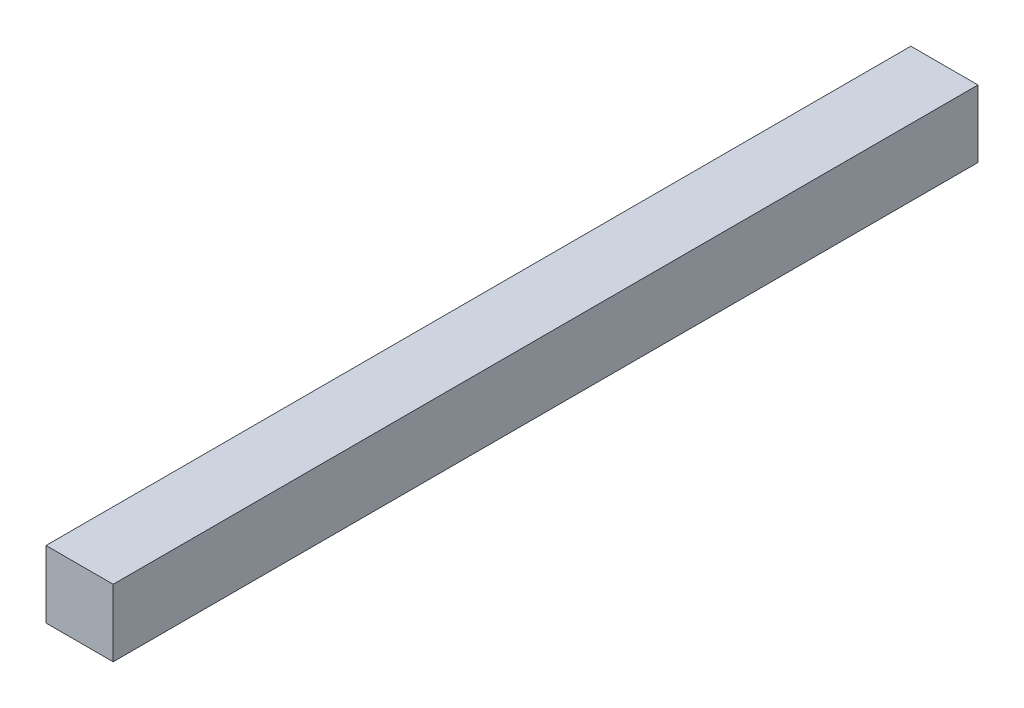
ISO-10303-21;
HEADER;
FILE_DESCRIPTION(('STEP AP214'),'2;1');
FILE_NAME('part.step','',(''),(''),'','','');
FILE_SCHEMA(('AUTOMOTIVE_DESIGN { 1 0 10303 214 1 1 1 1 }'));
ENDSEC;
DATA;
#1=APPLICATION_CONTEXT('core data for automotive mechanical design processes');
#2=APPLICATION_PROTOCOL_DEFINITION('international standard','automotive_design',2000,#1);
#3=PRODUCT_CONTEXT('',#1,'mechanical');
#4=PRODUCT('Part','Part','',(#3));
#5=PRODUCT_RELATED_PRODUCT_CATEGORY('part','',(#4));
#6=PRODUCT_DEFINITION_FORMATION('','',#4);
#7=PRODUCT_DEFINITION_CONTEXT('part definition',#1,'design');
#8=PRODUCT_DEFINITION('design','',#6,#7);
#9=PRODUCT_DEFINITION_SHAPE('','',#8);
#10=(LENGTH_UNIT() NAMED_UNIT(*) SI_UNIT(.MILLI.,.METRE.));
#11=(NAMED_UNIT(*) PLANE_ANGLE_UNIT() SI_UNIT($,.RADIAN.));
#12=(NAMED_UNIT(*) SI_UNIT($,.STERADIAN.) SOLID_ANGLE_UNIT());
#13=UNCERTAINTY_MEASURE_WITH_UNIT(LENGTH_MEASURE(1.E-05),#10,'distance_accuracy_value','');
#14=(GEOMETRIC_REPRESENTATION_CONTEXT(3) GLOBAL_UNCERTAINTY_ASSIGNED_CONTEXT((#13)) GLOBAL_UNIT_ASSIGNED_CONTEXT((#10,
#11,#12)) REPRESENTATION_CONTEXT('',''));
#15=CARTESIAN_POINT('',(0.,0.,0.));
#16=DIRECTION('',(0.,0.,1.));
#17=DIRECTION('',(1.,0.,0.));
#18=AXIS2_PLACEMENT_3D('',#15,#16,#17);
#19=CARTESIAN_POINT('',(0.,0.,327.025));
#20=DIRECTION('',(1.,0.,0.));
#21=DIRECTION('',(0.,0.,-1.));
#22=AXIS2_PLACEMENT_3D('',#19,#20,#21);
#23=PLANE('',#22);
#24=DIRECTION('',(0.,-1.,0.));
#25=VECTOR('',#24,1.);
#26=CARTESIAN_POINT('',(0.,0.,0.));
#27=LINE('',#26,#25);
#28=CARTESIAN_POINT('',(0.,25.4,0.));
#29=VERTEX_POINT('',#28);
#30=CARTESIAN_POINT('',(0.,0.,0.));
#31=VERTEX_POINT('',#30);
#32=EDGE_CURVE('E96',#29,#31,#27,.T.);
#33=ORIENTED_EDGE('',*,*,#32,.T.);
#34=DIRECTION('',(0.,0.,-1.));
#35=VECTOR('',#34,1.);
#36=CARTESIAN_POINT('',(0.,0.,327.025));
#37=LINE('',#36,#35);
#38=CARTESIAN_POINT('',(0.,0.,327.025));
#39=VERTEX_POINT('',#38);
#40=EDGE_CURVE('E11',#39,#31,#37,.T.);
#41=ORIENTED_EDGE('',*,*,#40,.F.);
#42=DIRECTION('',(0.,-1.,0.));
#43=VECTOR('',#42,1.);
#44=CARTESIAN_POINT('',(0.,0.,327.025));
#45=LINE('',#44,#43);
#46=CARTESIAN_POINT('',(0.,25.4,327.025));
#47=VERTEX_POINT('',#46);
#48=EDGE_CURVE('E84',#47,#39,#45,.T.);
#49=ORIENTED_EDGE('',*,*,#48,.F.);
#50=DIRECTION('',(0.,0.,-1.));
#51=VECTOR('',#50,1.);
#52=CARTESIAN_POINT('',(0.,25.4,327.025));
#53=LINE('',#52,#51);
#54=EDGE_CURVE('E92',#47,#29,#53,.T.);
#55=ORIENTED_EDGE('',*,*,#54,.T.);
#56=EDGE_LOOP('',(#33,#41,#49,#55));
#57=FACE_BOUND('',#56,.T.);
#58=ADVANCED_FACE('F33',(#57),#23,.F.);
#59=CARTESIAN_POINT('',(0.,0.,327.025));
#60=DIRECTION('',(0.,1.,0.));
#61=DIRECTION('',(0.,0.,1.));
#62=AXIS2_PLACEMENT_3D('',#59,#60,#61);
#63=PLANE('',#62);
#64=DIRECTION('',(1.,0.,0.));
#65=VECTOR('',#64,1.);
#66=CARTESIAN_POINT('',(0.,0.,0.));
#67=LINE('',#66,#65);
#68=CARTESIAN_POINT('',(25.4,0.,0.));
#69=VERTEX_POINT('',#68);
#70=EDGE_CURVE('E88',#31,#69,#67,.T.);
#71=ORIENTED_EDGE('',*,*,#70,.T.);
#72=DIRECTION('',(0.,0.,-1.));
#73=VECTOR('',#72,1.);
#74=CARTESIAN_POINT('',(25.4,0.,327.025));
#75=LINE('',#74,#73);
#76=CARTESIAN_POINT('',(25.4,0.,327.025));
#77=VERTEX_POINT('',#76);
#78=EDGE_CURVE('E41',#77,#69,#75,.T.);
#79=ORIENTED_EDGE('',*,*,#78,.F.);
#80=DIRECTION('',(1.,0.,0.));
#81=VECTOR('',#80,1.);
#82=CARTESIAN_POINT('',(0.,0.,327.025));
#83=LINE('',#82,#81);
#84=EDGE_CURVE('E79',#39,#77,#83,.T.);
#85=ORIENTED_EDGE('',*,*,#84,.F.);
#86=ORIENTED_EDGE('',*,*,#40,.T.);
#87=EDGE_LOOP('',(#71,#79,#85,#86));
#88=FACE_BOUND('',#87,.T.);
#89=ADVANCED_FACE('F87',(#88),#63,.F.);
#90=CARTESIAN_POINT('',(25.4,0.,327.025));
#91=DIRECTION('',(-1.,0.,0.));
#92=DIRECTION('',(0.,0.,1.));
#93=AXIS2_PLACEMENT_3D('',#90,#91,#92);
#94=PLANE('',#93);
#95=DIRECTION('',(0.,1.,0.));
#96=VECTOR('',#95,1.);
#97=CARTESIAN_POINT('',(25.4,0.,0.));
#98=LINE('',#97,#96);
#99=CARTESIAN_POINT('',(25.4,25.4,0.));
#100=VERTEX_POINT('',#99);
#101=EDGE_CURVE('E66',#69,#100,#98,.T.);
#102=ORIENTED_EDGE('',*,*,#101,.T.);
#103=DIRECTION('',(0.,0.,-1.));
#104=VECTOR('',#103,1.);
#105=CARTESIAN_POINT('',(25.4,25.4,327.025));
#106=LINE('',#105,#104);
#107=CARTESIAN_POINT('',(25.4,25.4,327.025));
#108=VERTEX_POINT('',#107);
#109=EDGE_CURVE('E89',#108,#100,#106,.T.);
#110=ORIENTED_EDGE('',*,*,#109,.F.);
#111=DIRECTION('',(0.,1.,0.));
#112=VECTOR('',#111,1.);
#113=CARTESIAN_POINT('',(25.4,0.,327.025));
#114=LINE('',#113,#112);
#115=EDGE_CURVE('E82',#77,#108,#114,.T.);
#116=ORIENTED_EDGE('',*,*,#115,.F.);
#117=ORIENTED_EDGE('',*,*,#78,.T.);
#118=EDGE_LOOP('',(#102,#110,#116,#117));
#119=FACE_BOUND('',#118,.T.);
#120=ADVANCED_FACE('F90',(#119),#94,.F.);
#121=CARTESIAN_POINT('',(0.,25.4,327.025));
#122=DIRECTION('',(0.,-1.,0.));
#123=DIRECTION('',(0.,0.,-1.));
#124=AXIS2_PLACEMENT_3D('',#121,#122,#123);
#125=PLANE('',#124);
#126=DIRECTION('',(-1.,0.,0.));
#127=VECTOR('',#126,1.);
#128=CARTESIAN_POINT('',(0.,25.4,0.));
#129=LINE('',#128,#127);
#130=EDGE_CURVE('E72',#100,#29,#129,.T.);
#131=ORIENTED_EDGE('',*,*,#130,.T.);
#132=ORIENTED_EDGE('',*,*,#54,.F.);
#133=DIRECTION('',(-1.,0.,0.));
#134=VECTOR('',#133,1.);
#135=CARTESIAN_POINT('',(0.,25.4,327.025));
#136=LINE('',#135,#134);
#137=EDGE_CURVE('E49',#108,#47,#136,.T.);
#138=ORIENTED_EDGE('',*,*,#137,.F.);
#139=ORIENTED_EDGE('',*,*,#109,.T.);
#140=EDGE_LOOP('',(#131,#132,#138,#139));
#141=FACE_BOUND('',#140,.T.);
#142=ADVANCED_FACE('F103',(#141),#125,.F.);
#143=CARTESIAN_POINT('',(0.,0.,327.025));
#144=DIRECTION('',(0.,0.,-1.));
#145=DIRECTION('',(-1.,0.,0.));
#146=AXIS2_PLACEMENT_3D('',#143,#144,#145);
#147=PLANE('',#146);
#148=ORIENTED_EDGE('',*,*,#48,.T.);
#149=ORIENTED_EDGE('',*,*,#84,.T.);
#150=ORIENTED_EDGE('',*,*,#115,.T.);
#151=ORIENTED_EDGE('',*,*,#137,.T.);
#152=EDGE_LOOP('',(#148,#149,#150,#151));
#153=FACE_BOUND('',#152,.T.);
#154=ADVANCED_FACE('F80',(#153),#147,.F.);
#155=CARTESIAN_POINT('',(0.,0.,0.));
#156=DIRECTION('',(0.,0.,-1.));
#157=DIRECTION('',(-1.,0.,0.));
#158=AXIS2_PLACEMENT_3D('',#155,#156,#157);
#159=PLANE('',#158);
#160=ORIENTED_EDGE('',*,*,#32,.F.);
#161=ORIENTED_EDGE('',*,*,#130,.F.);
#162=ORIENTED_EDGE('',*,*,#101,.F.);
#163=ORIENTED_EDGE('',*,*,#70,.F.);
#164=EDGE_LOOP('',(#160,#161,#162,#163));
#165=FACE_BOUND('',#164,.T.);
#166=ADVANCED_FACE('F106',(#165),#159,.T.);
#167=CLOSED_SHELL('',(#58,#89,#120,#142,#154,#166));
#168=MANIFOLD_SOLID_BREP('B2',#167);
#169=ADVANCED_BREP_SHAPE_REPRESENTATION('',(#18,#168),#14);
#170=SHAPE_DEFINITION_REPRESENTATION(#9,#169);
ENDSEC;
END-ISO-10303-21;
